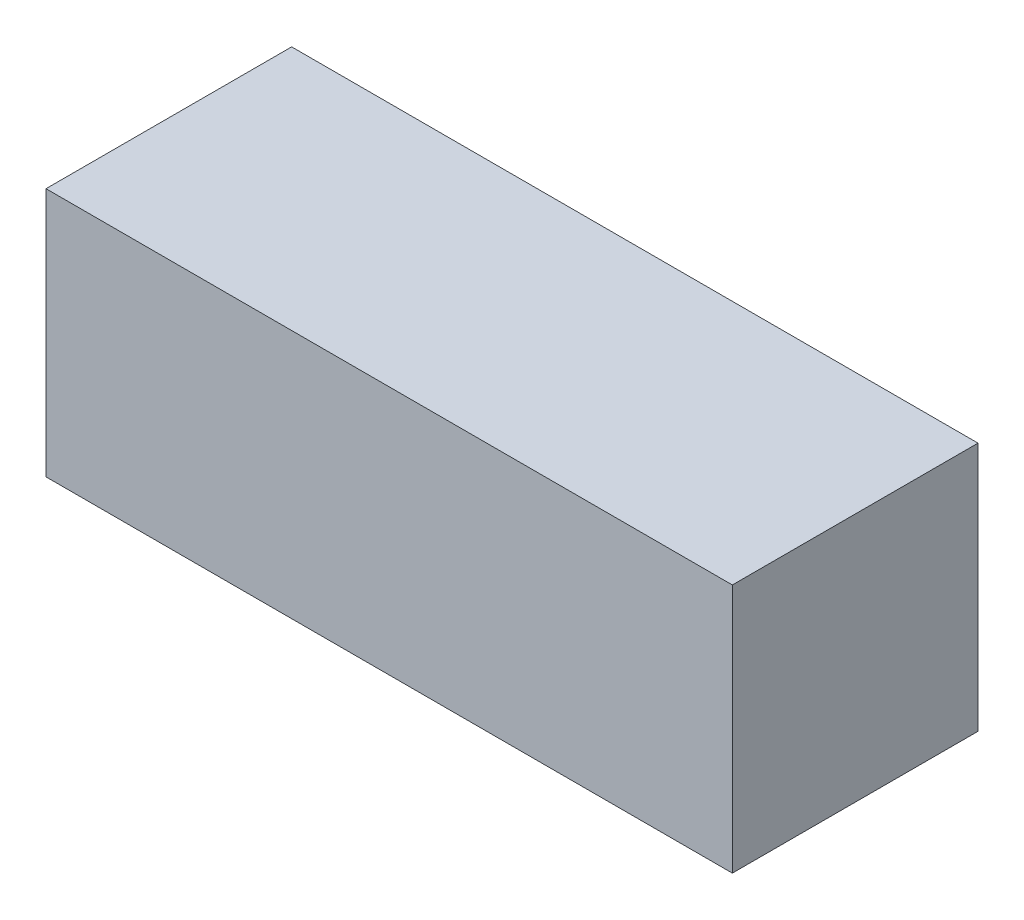
ISO-10303-21;
HEADER;
FILE_DESCRIPTION(('STEP AP214'),'2;1');
FILE_NAME('part.step','',(''),(''),'','','');
FILE_SCHEMA(('AUTOMOTIVE_DESIGN { 1 0 10303 214 1 1 1 1 }'));
ENDSEC;
DATA;
#1=APPLICATION_CONTEXT('core data for automotive mechanical design processes');
#2=APPLICATION_PROTOCOL_DEFINITION('international standard','automotive_design',2000,#1);
#3=PRODUCT_CONTEXT('',#1,'mechanical');
#4=PRODUCT('Part','Part','',(#3));
#5=PRODUCT_RELATED_PRODUCT_CATEGORY('part','',(#4));
#6=PRODUCT_DEFINITION_FORMATION('','',#4);
#7=PRODUCT_DEFINITION_CONTEXT('part definition',#1,'design');
#8=PRODUCT_DEFINITION('design','',#6,#7);
#9=PRODUCT_DEFINITION_SHAPE('','',#8);
#10=(LENGTH_UNIT() NAMED_UNIT(*) SI_UNIT(.MILLI.,.METRE.));
#11=(NAMED_UNIT(*) PLANE_ANGLE_UNIT() SI_UNIT($,.RADIAN.));
#12=(NAMED_UNIT(*) SI_UNIT($,.STERADIAN.) SOLID_ANGLE_UNIT());
#13=UNCERTAINTY_MEASURE_WITH_UNIT(LENGTH_MEASURE(1.E-05),#10,'distance_accuracy_value','');
#14=(GEOMETRIC_REPRESENTATION_CONTEXT(3) GLOBAL_UNCERTAINTY_ASSIGNED_CONTEXT((#13)) GLOBAL_UNIT_ASSIGNED_CONTEXT((#10,
#11,#12)) REPRESENTATION_CONTEXT('',''));
#15=CARTESIAN_POINT('',(0.,0.,0.));
#16=DIRECTION('',(0.,0.,1.));
#17=DIRECTION('',(1.,0.,0.));
#18=AXIS2_PLACEMENT_3D('',#15,#16,#17);
#19=CARTESIAN_POINT('',(0.,0.,0.1999996));
#20=DIRECTION('',(0.,0.,1.));
#21=DIRECTION('',(1.,0.,0.));
#22=AXIS2_PLACEMENT_3D('',#19,#20,#21);
#23=PLANE('',#22);
#24=DIRECTION('',(1.,0.,0.));
#25=VECTOR('',#24,1.);
#26=CARTESIAN_POINT('',(-0.2794,-0.1016,0.1999996));
#27=LINE('',#26,#25);
#28=CARTESIAN_POINT('',(-0.2794,-0.1016,0.1999996));
#29=VERTEX_POINT('',#28);
#30=CARTESIAN_POINT('',(0.2794,-0.1016,0.1999996));
#31=VERTEX_POINT('',#30);
#32=EDGE_CURVE('E82',#29,#31,#27,.T.);
#33=ORIENTED_EDGE('',*,*,#32,.T.);
#34=DIRECTION('',(0.,1.,0.));
#35=VECTOR('',#34,1.);
#36=CARTESIAN_POINT('',(0.2794,-0.1016,0.1999996));
#37=LINE('',#36,#35);
#38=CARTESIAN_POINT('',(0.2794,0.1016,0.1999996));
#39=VERTEX_POINT('',#38);
#40=EDGE_CURVE('E109',#31,#39,#37,.T.);
#41=ORIENTED_EDGE('',*,*,#40,.T.);
#42=DIRECTION('',(-1.,0.,0.));
#43=VECTOR('',#42,1.);
#44=CARTESIAN_POINT('',(0.2794,0.1016,0.1999996));
#45=LINE('',#44,#43);
#46=CARTESIAN_POINT('',(-0.2794,0.1016,0.1999996));
#47=VERTEX_POINT('',#46);
#48=EDGE_CURVE('E20',#39,#47,#45,.T.);
#49=ORIENTED_EDGE('',*,*,#48,.T.);
#50=DIRECTION('',(0.,-1.,0.));
#51=VECTOR('',#50,1.);
#52=CARTESIAN_POINT('',(-0.2794,0.1016,0.1999996));
#53=LINE('',#52,#51);
#54=EDGE_CURVE('E11',#47,#29,#53,.T.);
#55=ORIENTED_EDGE('',*,*,#54,.T.);
#56=EDGE_LOOP('',(#33,#41,#49,#55));
#57=FACE_BOUND('',#56,.T.);
#58=ADVANCED_FACE('F17',(#57),#23,.T.);
#59=CARTESIAN_POINT('',(0.,0.,0.));
#60=DIRECTION('',(0.,0.,1.));
#61=DIRECTION('',(1.,0.,0.));
#62=AXIS2_PLACEMENT_3D('',#59,#60,#61);
#63=PLANE('',#62);
#64=DIRECTION('',(0.,-1.,0.));
#65=VECTOR('',#64,1.);
#66=CARTESIAN_POINT('',(-0.2794,0.1016,0.));
#67=LINE('',#66,#65);
#68=CARTESIAN_POINT('',(-0.2794,0.1016,0.));
#69=VERTEX_POINT('',#68);
#70=CARTESIAN_POINT('',(-0.2794,-0.1016,0.));
#71=VERTEX_POINT('',#70);
#72=EDGE_CURVE('E26',#69,#71,#67,.T.);
#73=ORIENTED_EDGE('',*,*,#72,.F.);
#74=DIRECTION('',(-1.,0.,0.));
#75=VECTOR('',#74,1.);
#76=CARTESIAN_POINT('',(0.2794,0.1016,0.));
#77=LINE('',#76,#75);
#78=CARTESIAN_POINT('',(0.2794,0.1016,0.));
#79=VERTEX_POINT('',#78);
#80=EDGE_CURVE('E105',#79,#69,#77,.T.);
#81=ORIENTED_EDGE('',*,*,#80,.F.);
#82=DIRECTION('',(0.,1.,0.));
#83=VECTOR('',#82,1.);
#84=CARTESIAN_POINT('',(0.2794,-0.1016,0.));
#85=LINE('',#84,#83);
#86=CARTESIAN_POINT('',(0.2794,-0.1016,0.));
#87=VERTEX_POINT('',#86);
#88=EDGE_CURVE('E84',#87,#79,#85,.T.);
#89=ORIENTED_EDGE('',*,*,#88,.F.);
#90=DIRECTION('',(1.,0.,0.));
#91=VECTOR('',#90,1.);
#92=CARTESIAN_POINT('',(-0.2794,-0.1016,0.));
#93=LINE('',#92,#91);
#94=EDGE_CURVE('E80',#71,#87,#93,.T.);
#95=ORIENTED_EDGE('',*,*,#94,.F.);
#96=EDGE_LOOP('',(#73,#81,#89,#95));
#97=FACE_BOUND('',#96,.T.);
#98=ADVANCED_FACE('F86',(#97),#63,.F.);
#99=CARTESIAN_POINT('',(-0.2794,0.1016,0.));
#100=DIRECTION('',(1.,0.,0.));
#101=DIRECTION('',(0.,1.,0.));
#102=AXIS2_PLACEMENT_3D('',#99,#100,#101);
#103=PLANE('',#102);
#104=ORIENTED_EDGE('',*,*,#72,.T.);
#105=DIRECTION('',(0.,0.,1.));
#106=VECTOR('',#105,1.);
#107=CARTESIAN_POINT('',(-0.2794,-0.1016,0.));
#108=LINE('',#107,#106);
#109=EDGE_CURVE('E70',#71,#29,#108,.T.);
#110=ORIENTED_EDGE('',*,*,#109,.T.);
#111=ORIENTED_EDGE('',*,*,#54,.F.);
#112=DIRECTION('',(0.,0.,1.));
#113=VECTOR('',#112,1.);
#114=CARTESIAN_POINT('',(-0.2794,0.1016,0.));
#115=LINE('',#114,#113);
#116=EDGE_CURVE('E73',#69,#47,#115,.T.);
#117=ORIENTED_EDGE('',*,*,#116,.F.);
#118=EDGE_LOOP('',(#104,#110,#111,#117));
#119=FACE_BOUND('',#118,.T.);
#120=ADVANCED_FACE('F69',(#119),#103,.F.);
#121=CARTESIAN_POINT('',(0.2794,0.1016,0.));
#122=DIRECTION('',(0.,-1.,0.));
#123=DIRECTION('',(0.,0.,-1.));
#124=AXIS2_PLACEMENT_3D('',#121,#122,#123);
#125=PLANE('',#124);
#126=ORIENTED_EDGE('',*,*,#80,.T.);
#127=ORIENTED_EDGE('',*,*,#116,.T.);
#128=ORIENTED_EDGE('',*,*,#48,.F.);
#129=DIRECTION('',(0.,0.,1.));
#130=VECTOR('',#129,1.);
#131=CARTESIAN_POINT('',(0.2794,0.1016,0.));
#132=LINE('',#131,#130);
#133=EDGE_CURVE('E100',#79,#39,#132,.T.);
#134=ORIENTED_EDGE('',*,*,#133,.F.);
#135=EDGE_LOOP('',(#126,#127,#128,#134));
#136=FACE_BOUND('',#135,.T.);
#137=ADVANCED_FACE('F121',(#136),#125,.F.);
#138=CARTESIAN_POINT('',(0.2794,-0.1016,0.));
#139=DIRECTION('',(-1.,0.,0.));
#140=DIRECTION('',(0.,0.,1.));
#141=AXIS2_PLACEMENT_3D('',#138,#139,#140);
#142=PLANE('',#141);
#143=ORIENTED_EDGE('',*,*,#88,.T.);
#144=ORIENTED_EDGE('',*,*,#133,.T.);
#145=ORIENTED_EDGE('',*,*,#40,.F.);
#146=DIRECTION('',(0.,0.,1.));
#147=VECTOR('',#146,1.);
#148=CARTESIAN_POINT('',(0.2794,-0.1016,0.));
#149=LINE('',#148,#147);
#150=EDGE_CURVE('E90',#87,#31,#149,.T.);
#151=ORIENTED_EDGE('',*,*,#150,.F.);
#152=EDGE_LOOP('',(#143,#144,#145,#151));
#153=FACE_BOUND('',#152,.T.);
#154=ADVANCED_FACE('F119',(#153),#142,.F.);
#155=CARTESIAN_POINT('',(-0.2794,-0.1016,0.));
#156=DIRECTION('',(0.,1.,0.));
#157=DIRECTION('',(1.,0.,0.));
#158=AXIS2_PLACEMENT_3D('',#155,#156,#157);
#159=PLANE('',#158);
#160=ORIENTED_EDGE('',*,*,#94,.T.);
#161=ORIENTED_EDGE('',*,*,#150,.T.);
#162=ORIENTED_EDGE('',*,*,#32,.F.);
#163=ORIENTED_EDGE('',*,*,#109,.F.);
#164=EDGE_LOOP('',(#160,#161,#162,#163));
#165=FACE_BOUND('',#164,.T.);
#166=ADVANCED_FACE('F78',(#165),#159,.F.);
#167=CLOSED_SHELL('',(#58,#98,#120,#137,#154,#166));
#168=MANIFOLD_SOLID_BREP('B1',#167);
#169=ADVANCED_BREP_SHAPE_REPRESENTATION('',(#18,#168),#14);
#170=SHAPE_DEFINITION_REPRESENTATION(#9,#169);
ENDSEC;
END-ISO-10303-21;
